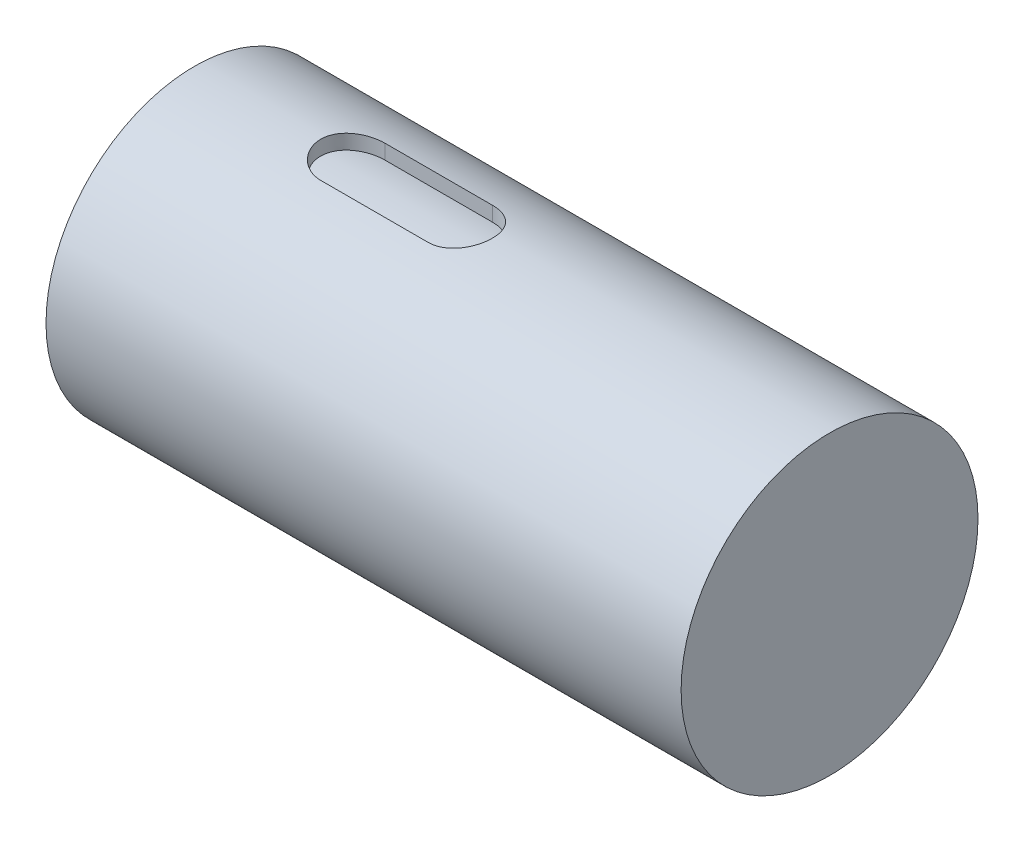
ISO-10303-21;
HEADER;
FILE_DESCRIPTION(('STEP AP214'),'2;1');
FILE_NAME('part.step','',(''),(''),'','','');
FILE_SCHEMA(('AUTOMOTIVE_DESIGN { 1 0 10303 214 1 1 1 1 }'));
ENDSEC;
DATA;
#1=APPLICATION_CONTEXT('core data for automotive mechanical design processes');
#2=APPLICATION_PROTOCOL_DEFINITION('international standard','automotive_design',2000,#1);
#3=PRODUCT_CONTEXT('',#1,'mechanical');
#4=PRODUCT('Part','Part','',(#3));
#5=PRODUCT_RELATED_PRODUCT_CATEGORY('part','',(#4));
#6=PRODUCT_DEFINITION_FORMATION('','',#4);
#7=PRODUCT_DEFINITION_CONTEXT('part definition',#1,'design');
#8=PRODUCT_DEFINITION('design','',#6,#7);
#9=PRODUCT_DEFINITION_SHAPE('','',#8);
#10=(LENGTH_UNIT() NAMED_UNIT(*) SI_UNIT(.MILLI.,.METRE.));
#11=(NAMED_UNIT(*) PLANE_ANGLE_UNIT() SI_UNIT($,.RADIAN.));
#12=(NAMED_UNIT(*) SI_UNIT($,.STERADIAN.) SOLID_ANGLE_UNIT());
#13=UNCERTAINTY_MEASURE_WITH_UNIT(LENGTH_MEASURE(1.E-05),#10,'distance_accuracy_value','');
#14=(GEOMETRIC_REPRESENTATION_CONTEXT(3) GLOBAL_UNCERTAINTY_ASSIGNED_CONTEXT((#13)) GLOBAL_UNIT_ASSIGNED_CONTEXT((#10,
#11,#12)) REPRESENTATION_CONTEXT('',''));
#15=CARTESIAN_POINT('',(0.,0.,0.));
#16=DIRECTION('',(0.,0.,1.));
#17=DIRECTION('',(1.,0.,0.));
#18=AXIS2_PLACEMENT_3D('',#15,#16,#17);
#19=CARTESIAN_POINT('',(130.,0.,0.));
#20=DIRECTION('',(-1.,0.,0.));
#21=DIRECTION('',(0.,0.,1.));
#22=AXIS2_PLACEMENT_3D('',#19,#20,#21);
#23=CYLINDRICAL_SURFACE('',#22,60.7681555195422);
#24=CARTESIAN_POINT('',(-130.,0.,0.));
#25=DIRECTION('',(1.,0.,0.));
#26=DIRECTION('',(0.,0.,-1.));
#27=AXIS2_PLACEMENT_3D('',#24,#25,#26);
#28=CIRCLE('',#27,60.7681555195422);
#29=CARTESIAN_POINT('',(-130.,0.,-60.7681555195422));
#30=VERTEX_POINT('',#29);
#31=EDGE_CURVE('E43',#30,#30,#28,.T.);
#32=ORIENTED_EDGE('',*,*,#31,.T.);
#33=EDGE_LOOP('',(#32));
#34=FACE_BOUND('',#33,.T.);
#35=CARTESIAN_POINT('',(130.,0.,0.));
#36=DIRECTION('',(1.,0.,0.));
#37=DIRECTION('',(0.,0.,-1.));
#38=AXIS2_PLACEMENT_3D('',#35,#36,#37);
#39=CIRCLE('',#38,60.7681555195422);
#40=CARTESIAN_POINT('',(130.,0.,-60.7681555195422));
#41=VERTEX_POINT('',#40);
#42=EDGE_CURVE('E11',#41,#41,#39,.T.);
#43=ORIENTED_EDGE('',*,*,#42,.F.);
#44=EDGE_LOOP('',(#43));
#45=FACE_BOUND('',#44,.T.);
#46=CARTESIAN_POINT('',(-21.2222588630616,59.3243820454148,13.1676277353563));
#47=CARTESIAN_POINT('',(-19.4771199425059,59.3243820454149,13.1676277353563));
#48=CARTESIAN_POINT('',(-17.7651329020504,59.4038251078294,12.8222554680992));
#49=CARTESIAN_POINT('',(-14.579008870894,59.6740771859081,11.4990949531283));
#50=CARTESIAN_POINT('',(-13.1218030710229,59.8629237453531,10.521387908889));
#51=CARTESIAN_POINT('',(-10.7008309812277,60.2382992785804,8.10040387236693));
#52=CARTESIAN_POINT('',(-9.72051803548849,60.4256326993225,6.63587755443867));
#53=CARTESIAN_POINT('',(-8.40491062108355,60.6897970090929,3.46994193410022));
#54=CARTESIAN_POINT('',(-8.05607540678742,60.7678425641329,1.73394894995495));
#55=CARTESIAN_POINT('',(-8.05391588354741,60.7683105031119,-0.850470309829686));
#56=CARTESIAN_POINT('',(-8.13979435694679,60.7495361151024,-1.72582243719729));
#57=CARTESIAN_POINT('',(-8.47640094026999,60.6779379579956,-3.41649622427681));
#58=CARTESIAN_POINT('',(-8.7255211642282,60.6254551424538,-4.23854423690565));
#59=CARTESIAN_POINT('',(-9.71761279524744,60.426148300215,-6.63465897919074));
#60=CARTESIAN_POINT('',(-10.6849146735676,60.2408574139847,-8.08329328862965));
#61=CARTESIAN_POINT('',(-12.5177108135997,59.9565443083504,-9.91788644958037));
#62=CARTESIAN_POINT('',(-13.1793786647249,59.8629409592454,-10.460976865175));
#63=CARTESIAN_POINT('',(-14.6022496471712,59.6884268549925,-11.4147026610442));
#64=CARTESIAN_POINT('',(-15.3728746710388,59.6067951069766,-11.8284609029469));
#65=CARTESIAN_POINT('',(-17.7580783672696,59.4043141639832,-12.819958034078));
#66=CARTESIAN_POINT('',(-19.47710014302,59.3243820454148,-13.1676277353563));
#67=CARTESIAN_POINT('',(-21.2222588630616,59.3243820454148,-13.1676277353563));
#68=B_SPLINE_CURVE_WITH_KNOTS('',3,(#46,#47,#48,#49,#50,#51,#52,#53,#54,#55,#56,#57,#58,#59,#60,
#61,#62,#63,#64,#65,#66,#67),.UNSPECIFIED.,.F.,.F.,(4,2,2,2,2,2,2,2,2,2,4),(0.,0.125,0.25,0.375,
0.5,0.5625,0.625,0.75,0.8125,0.875,1.),.UNSPECIFIED.);
#69=CARTESIAN_POINT('',(-21.2222588630616,59.3243820454148,13.1676277353563));
#70=VERTEX_POINT('',#69);
#71=CARTESIAN_POINT('',(-21.2222588630616,59.3243820454148,-13.1676277353563));
#72=VERTEX_POINT('',#71);
#73=EDGE_CURVE('E143',#70,#72,#68,.T.);
#74=ORIENTED_EDGE('',*,*,#73,.F.);
#75=DIRECTION('',(-1.,0.,0.));
#76=VECTOR('',#75,1.);
#77=CARTESIAN_POINT('',(130.,59.3243820454148,13.1676277353563));
#78=LINE('',#77,#76);
#79=CARTESIAN_POINT('',(-65.1284046774016,59.3243820454148,13.1676277353563));
#80=VERTEX_POINT('',#79);
#81=EDGE_CURVE('E155',#70,#80,#78,.T.);
#82=ORIENTED_EDGE('',*,*,#81,.T.);
#83=CARTESIAN_POINT('',(-65.1284046774016,59.3243820454148,-13.1676277353563));
#84=CARTESIAN_POINT('',(-66.8735435979573,59.3243820454148,-13.1676277353563));
#85=CARTESIAN_POINT('',(-68.5855306384128,59.4038251078294,-12.8222554680992));
#86=CARTESIAN_POINT('',(-71.7716546695692,59.6740771859081,-11.4990949531283));
#87=CARTESIAN_POINT('',(-73.2288604694403,59.8629237453531,-10.521387908889));
#88=CARTESIAN_POINT('',(-75.6498325592355,60.2382992785803,-8.10040387236693));
#89=CARTESIAN_POINT('',(-76.6301455049747,60.4256326993225,-6.63587755443867));
#90=CARTESIAN_POINT('',(-77.9457529193797,60.6897970090929,-3.46994193410022));
#91=CARTESIAN_POINT('',(-78.2945881336758,60.7678425641329,-1.73394894995495));
#92=CARTESIAN_POINT('',(-78.2967476569158,60.7683105031119,0.850470309829684));
#93=CARTESIAN_POINT('',(-78.2108691835164,60.7495361151024,1.72582243719729));
#94=CARTESIAN_POINT('',(-77.8742626001932,60.6779379579956,3.41649622427681));
#95=CARTESIAN_POINT('',(-77.625142376235,60.6254551424538,4.23854423690565));
#96=CARTESIAN_POINT('',(-76.6330507452158,60.426148300215,6.63465897919074));
#97=CARTESIAN_POINT('',(-75.6657488668956,60.2408574139847,8.08329328862966));
#98=CARTESIAN_POINT('',(-73.8329527268635,59.9565443083504,9.91788644958037));
#99=CARTESIAN_POINT('',(-73.1712848757383,59.8629409592454,10.460976865175));
#100=CARTESIAN_POINT('',(-71.748413893292,59.6884268549925,11.4147026610442));
#101=CARTESIAN_POINT('',(-70.9777888694244,59.6067951069766,11.8284609029469));
#102=CARTESIAN_POINT('',(-68.5925851731937,59.4043141639832,12.819958034078));
#103=CARTESIAN_POINT('',(-66.8735633974432,59.3243820454148,13.1676277353563));
#104=CARTESIAN_POINT('',(-65.1284046774016,59.3243820454148,13.1676277353563));
#105=B_SPLINE_CURVE_WITH_KNOTS('',3,(#83,#84,#85,#86,#87,#88,#89,#90,#91,#92,#93,#94,#95,#96,
#97,#98,#99,#100,#101,#102,#103,#104),.UNSPECIFIED.,.F.,.F.,(4,2,2,2,2,2,2,2,2,2,4),(0.,0.125,
0.250000000000001,0.375000000000001,0.500000000000001,0.562500000000001,0.625000000000002,
0.750000000000001,0.812500000000001,0.875000000000001,1.),.UNSPECIFIED.);
#106=CARTESIAN_POINT('',(-65.1284046774016,59.3243820454148,-13.1676277353563));
#107=VERTEX_POINT('',#106);
#108=EDGE_CURVE('E60',#107,#80,#105,.T.);
#109=ORIENTED_EDGE('',*,*,#108,.F.);
#110=DIRECTION('',(-1.,0.,0.));
#111=VECTOR('',#110,1.);
#112=CARTESIAN_POINT('',(130.,59.3243820454148,-13.1676277353563));
#113=LINE('',#112,#111);
#114=EDGE_CURVE('E99',#72,#107,#113,.T.);
#115=ORIENTED_EDGE('',*,*,#114,.F.);
#116=EDGE_LOOP('',(#74,#82,#109,#115));
#117=FACE_BOUND('',#116,.T.);
#118=ADVANCED_FACE('F33',(#34,#45,#117),#23,.T.);
#119=CARTESIAN_POINT('',(130.,0.,0.));
#120=DIRECTION('',(1.,0.,0.));
#121=DIRECTION('',(0.,0.,-1.));
#122=AXIS2_PLACEMENT_3D('',#119,#120,#121);
#123=PLANE('',#122);
#124=ORIENTED_EDGE('',*,*,#42,.T.);
#125=EDGE_LOOP('',(#124));
#126=FACE_BOUND('',#125,.T.);
#127=ADVANCED_FACE('F130',(#126),#123,.T.);
#128=CARTESIAN_POINT('',(-130.,0.,0.));
#129=DIRECTION('',(1.,0.,0.));
#130=DIRECTION('',(0.,0.,-1.));
#131=AXIS2_PLACEMENT_3D('',#128,#129,#130);
#132=PLANE('',#131);
#133=ORIENTED_EDGE('',*,*,#31,.F.);
#134=EDGE_LOOP('',(#133));
#135=FACE_BOUND('',#134,.T.);
#136=ADVANCED_FACE('F125',(#135),#132,.F.);
#137=CARTESIAN_POINT('',(130.,-6.,0.));
#138=DIRECTION('',(-1.,0.,0.));
#139=DIRECTION('',(0.,0.,1.));
#140=AXIS2_PLACEMENT_3D('',#137,#138,#139);
#141=CYLINDRICAL_SURFACE('',#140,60.7681555195422);
#142=DIRECTION('',(-1.,0.,0.));
#143=VECTOR('',#142,1.);
#144=CARTESIAN_POINT('',(130.,53.3243820454148,13.1676277353563));
#145=LINE('',#144,#143);
#146=CARTESIAN_POINT('',(-21.2222588630616,53.3243820454148,13.1676277353563));
#147=VERTEX_POINT('',#146);
#148=CARTESIAN_POINT('',(-65.1284046774016,53.3243820454149,13.1676277353563));
#149=VERTEX_POINT('',#148);
#150=EDGE_CURVE('E168',#147,#149,#145,.T.);
#151=ORIENTED_EDGE('',*,*,#150,.F.);
#152=CARTESIAN_POINT('',(-21.2222588630616,53.3243820454149,-13.1676277353563));
#153=CARTESIAN_POINT('',(-19.47710014302,53.3243820454149,-13.1676277353563));
#154=CARTESIAN_POINT('',(-17.7580783672696,53.4043141639832,-12.819958034078));
#155=CARTESIAN_POINT('',(-15.3728746710388,53.6067951069766,-11.8284609029469));
#156=CARTESIAN_POINT('',(-14.6022496471712,53.6884268549925,-11.4147026610442));
#157=CARTESIAN_POINT('',(-13.1793786647249,53.8629409592455,-10.460976865175));
#158=CARTESIAN_POINT('',(-12.5177108135997,53.9565443083504,-9.91788644958037));
#159=CARTESIAN_POINT('',(-10.6849146735676,54.2408574139847,-8.08329328862965));
#160=CARTESIAN_POINT('',(-9.71761279524744,54.426148300215,-6.63465897919074));
#161=CARTESIAN_POINT('',(-8.7255211642282,54.6254551424538,-4.23854423690565));
#162=CARTESIAN_POINT('',(-8.47640094026999,54.6779379579957,-3.41649622427681));
#163=CARTESIAN_POINT('',(-8.13979435694679,54.7495361151025,-1.72582243719729));
#164=CARTESIAN_POINT('',(-8.05391588354741,54.7683105031119,-0.850470309829686));
#165=CARTESIAN_POINT('',(-8.05607540678742,54.7678425641329,1.73394894995495));
#166=CARTESIAN_POINT('',(-8.40491062108355,54.689797009093,3.46994193410022));
#167=CARTESIAN_POINT('',(-9.72051803548849,54.4256326993225,6.63587755443867));
#168=CARTESIAN_POINT('',(-10.7008309812277,54.2382992785804,8.10040387236693));
#169=CARTESIAN_POINT('',(-13.1218030710229,53.8629237453531,10.521387908889));
#170=CARTESIAN_POINT('',(-14.579008870894,53.6740771859082,11.4990949531283));
#171=CARTESIAN_POINT('',(-17.7651329020504,53.4038251078294,12.8222554680992));
#172=CARTESIAN_POINT('',(-19.4771199425059,53.3243820454149,13.1676277353563));
#173=CARTESIAN_POINT('',(-21.2222588630616,53.3243820454149,13.1676277353563));
#174=B_SPLINE_CURVE_WITH_KNOTS('',3,(#152,#153,#154,#155,#156,#157,#158,#159,#160,#161,#162,
#163,#164,#165,#166,#167,#168,#169,#170,#171,#172,#173),.UNSPECIFIED.,.F.,.F.,(4,2,2,2,2,2,2,2,
2,2,4),(0.,0.125,0.1875,0.25,0.375,0.4375,0.5,0.625,0.75,0.875,1.),.UNSPECIFIED.);
#175=CARTESIAN_POINT('',(-21.2222588630616,53.3243820454148,-13.1676277353563));
#176=VERTEX_POINT('',#175);
#177=EDGE_CURVE('E78',#147,#176,#174,.F.);
#178=ORIENTED_EDGE('',*,*,#177,.T.);
#179=DIRECTION('',(-1.,0.,0.));
#180=VECTOR('',#179,1.);
#181=CARTESIAN_POINT('',(130.,53.3243820454148,-13.1676277353563));
#182=LINE('',#181,#180);
#183=CARTESIAN_POINT('',(-65.1284046774016,53.3243820454149,-13.1676277353563));
#184=VERTEX_POINT('',#183);
#185=EDGE_CURVE('E84',#176,#184,#182,.T.);
#186=ORIENTED_EDGE('',*,*,#185,.T.);
#187=CARTESIAN_POINT('',(-65.1284046774016,53.3243820454149,13.1676277353563));
#188=CARTESIAN_POINT('',(-66.8735633974432,53.3243820454149,13.1676277353563));
#189=CARTESIAN_POINT('',(-68.5925851731937,53.4043141639832,12.819958034078));
#190=CARTESIAN_POINT('',(-70.9777888694244,53.6067951069766,11.8284609029469));
#191=CARTESIAN_POINT('',(-71.748413893292,53.6884268549925,11.4147026610442));
#192=CARTESIAN_POINT('',(-73.1712848757383,53.8629409592455,10.460976865175));
#193=CARTESIAN_POINT('',(-73.8329527268635,53.9565443083504,9.91788644958037));
#194=CARTESIAN_POINT('',(-75.6657488668956,54.2408574139847,8.08329328862966));
#195=CARTESIAN_POINT('',(-76.6330507452158,54.426148300215,6.63465897919074));
#196=CARTESIAN_POINT('',(-77.625142376235,54.6254551424538,4.23854423690565));
#197=CARTESIAN_POINT('',(-77.8742626001932,54.6779379579957,3.41649622427681));
#198=CARTESIAN_POINT('',(-78.2108691835164,54.7495361151025,1.72582243719729));
#199=CARTESIAN_POINT('',(-78.2967476569158,54.7683105031119,0.850470309829684));
#200=CARTESIAN_POINT('',(-78.2945881336758,54.7678425641329,-1.73394894995495));
#201=CARTESIAN_POINT('',(-77.9457529193797,54.689797009093,-3.46994193410022));
#202=CARTESIAN_POINT('',(-76.6301455049747,54.4256326993225,-6.63587755443867));
#203=CARTESIAN_POINT('',(-75.6498325592355,54.2382992785804,-8.10040387236693));
#204=CARTESIAN_POINT('',(-73.2288604694403,53.8629237453531,-10.521387908889));
#205=CARTESIAN_POINT('',(-71.7716546695692,53.6740771859082,-11.4990949531283));
#206=CARTESIAN_POINT('',(-68.5855306384128,53.4038251078295,-12.8222554680992));
#207=CARTESIAN_POINT('',(-66.8735435979573,53.3243820454149,-13.1676277353563));
#208=CARTESIAN_POINT('',(-65.1284046774016,53.3243820454149,-13.1676277353563));
#209=B_SPLINE_CURVE_WITH_KNOTS('',3,(#187,#188,#189,#190,#191,#192,#193,#194,#195,#196,#197,
#198,#199,#200,#201,#202,#203,#204,#205,#206,#207,#208),.UNSPECIFIED.,.F.,.F.,(4,2,2,2,2,2,2,2,
2,2,4),(0.,0.124999999999999,0.187499999999999,0.249999999999999,0.374999999999998,
0.437499999999999,0.499999999999999,0.624999999999999,0.749999999999999,0.875,1.),.UNSPECIFIED.);
#210=EDGE_CURVE('E87',#184,#149,#209,.F.);
#211=ORIENTED_EDGE('',*,*,#210,.T.);
#212=EDGE_LOOP('',(#151,#178,#186,#211));
#213=FACE_BOUND('',#212,.T.);
#214=ADVANCED_FACE('F101',(#213),#141,.T.);
#215=CARTESIAN_POINT('',(130.,59.3243820454148,13.1676277353563));
#216=DIRECTION('',(0.,0.,1.));
#217=DIRECTION('',(1.,0.,0.));
#218=AXIS2_PLACEMENT_3D('',#215,#216,#217);
#219=PLANE('',#218);
#220=ORIENTED_EDGE('',*,*,#150,.T.);
#221=DIRECTION('',(0.,-1.,0.));
#222=VECTOR('',#221,1.);
#223=CARTESIAN_POINT('',(-65.1284046774016,59.3243820454148,13.1676277353563));
#224=LINE('',#223,#222);
#225=EDGE_CURVE('E91',#80,#149,#224,.T.);
#226=ORIENTED_EDGE('',*,*,#225,.F.);
#227=ORIENTED_EDGE('',*,*,#81,.F.);
#228=DIRECTION('',(0.,-1.,0.));
#229=VECTOR('',#228,1.);
#230=CARTESIAN_POINT('',(-21.2222588630616,59.3243820454148,13.1676277353563));
#231=LINE('',#230,#229);
#232=EDGE_CURVE('E174',#70,#147,#231,.T.);
#233=ORIENTED_EDGE('',*,*,#232,.T.);
#234=EDGE_LOOP('',(#220,#226,#227,#233));
#235=FACE_BOUND('',#234,.T.);
#236=ADVANCED_FACE('F124',(#235),#219,.F.);
#237=CARTESIAN_POINT('',(-21.2222588630616,59.3243820454148,13.1676277353563));
#238=CARTESIAN_POINT('',(-19.4771199425059,59.3243820454149,13.1676277353563));
#239=CARTESIAN_POINT('',(-17.7651329020504,59.4038251078294,12.8222554680992));
#240=CARTESIAN_POINT('',(-14.579008870894,59.6740771859081,11.4990949531283));
#241=CARTESIAN_POINT('',(-13.1218030710229,59.8629237453531,10.521387908889));
#242=CARTESIAN_POINT('',(-10.7008309812277,60.2382992785804,8.10040387236693));
#243=CARTESIAN_POINT('',(-9.72051803548849,60.4256326993225,6.63587755443867));
#244=CARTESIAN_POINT('',(-8.40491062108355,60.6897970090929,3.46994193410022));
#245=CARTESIAN_POINT('',(-8.05607540678742,60.7678425641329,1.73394894995495));
#246=CARTESIAN_POINT('',(-8.05391588354741,60.7683105031119,-0.850470309829686));
#247=CARTESIAN_POINT('',(-8.13979435694679,60.7495361151024,-1.72582243719729));
#248=CARTESIAN_POINT('',(-8.47640094026999,60.6779379579956,-3.41649622427681));
#249=CARTESIAN_POINT('',(-8.7255211642282,60.6254551424538,-4.23854423690565));
#250=CARTESIAN_POINT('',(-9.71761279524744,60.426148300215,-6.63465897919074));
#251=CARTESIAN_POINT('',(-10.6849146735676,60.2408574139847,-8.08329328862965));
#252=CARTESIAN_POINT('',(-12.5177108135997,59.9565443083504,-9.91788644958037));
#253=CARTESIAN_POINT('',(-13.1793786647249,59.8629409592454,-10.460976865175));
#254=CARTESIAN_POINT('',(-14.6022496471712,59.6884268549925,-11.4147026610442));
#255=CARTESIAN_POINT('',(-15.3728746710388,59.6067951069766,-11.8284609029469));
#256=CARTESIAN_POINT('',(-17.7580783672696,59.4043141639832,-12.819958034078));
#257=CARTESIAN_POINT('',(-19.47710014302,59.3243820454148,-13.1676277353563));
#258=CARTESIAN_POINT('',(-21.2222588630616,59.3243820454148,-13.1676277353563));
#259=B_SPLINE_CURVE_WITH_KNOTS('',3,(#237,#238,#239,#240,#241,#242,#243,#244,#245,#246,#247,
#248,#249,#250,#251,#252,#253,#254,#255,#256,#257,#258),.UNSPECIFIED.,.F.,.F.,(4,2,2,2,2,2,2,2,
2,2,4),(0.,0.125,0.25,0.375,0.5,0.5625,0.625,0.75,0.8125,0.875,1.),.UNSPECIFIED.);
#260=DIRECTION('',(0.,-1.,0.));
#261=VECTOR('',#260,1.);
#262=SURFACE_OF_LINEAR_EXTRUSION('',#259,#261);
#263=ORIENTED_EDGE('',*,*,#177,.F.);
#264=ORIENTED_EDGE('',*,*,#232,.F.);
#265=ORIENTED_EDGE('',*,*,#73,.T.);
#266=DIRECTION('',(0.,-1.,0.));
#267=VECTOR('',#266,1.);
#268=CARTESIAN_POINT('',(-21.2222588630616,59.3243820454148,-13.1676277353563));
#269=LINE('',#268,#267);
#270=EDGE_CURVE('E51',#72,#176,#269,.T.);
#271=ORIENTED_EDGE('',*,*,#270,.T.);
#272=EDGE_LOOP('',(#263,#264,#265,#271));
#273=FACE_BOUND('',#272,.T.);
#274=ADVANCED_FACE('F126',(#273),#262,.T.);
#275=CARTESIAN_POINT('',(130.,59.3243820454148,-13.1676277353563));
#276=DIRECTION('',(0.,0.,1.));
#277=DIRECTION('',(1.,0.,0.));
#278=AXIS2_PLACEMENT_3D('',#275,#276,#277);
#279=PLANE('',#278);
#280=ORIENTED_EDGE('',*,*,#185,.F.);
#281=ORIENTED_EDGE('',*,*,#270,.F.);
#282=ORIENTED_EDGE('',*,*,#114,.T.);
#283=DIRECTION('',(0.,-1.,0.));
#284=VECTOR('',#283,1.);
#285=CARTESIAN_POINT('',(-65.1284046774016,59.3243820454148,-13.1676277353563));
#286=LINE('',#285,#284);
#287=EDGE_CURVE('E90',#107,#184,#286,.T.);
#288=ORIENTED_EDGE('',*,*,#287,.T.);
#289=EDGE_LOOP('',(#280,#281,#282,#288));
#290=FACE_BOUND('',#289,.T.);
#291=ADVANCED_FACE('F97',(#290),#279,.T.);
#292=CARTESIAN_POINT('',(-65.1284046774016,59.3243820454148,-13.1676277353563));
#293=CARTESIAN_POINT('',(-66.8735435979573,59.3243820454148,-13.1676277353563));
#294=CARTESIAN_POINT('',(-68.5855306384128,59.4038251078294,-12.8222554680992));
#295=CARTESIAN_POINT('',(-71.7716546695692,59.6740771859081,-11.4990949531283));
#296=CARTESIAN_POINT('',(-73.2288604694403,59.8629237453531,-10.521387908889));
#297=CARTESIAN_POINT('',(-75.6498325592355,60.2382992785803,-8.10040387236693));
#298=CARTESIAN_POINT('',(-76.6301455049747,60.4256326993225,-6.63587755443867));
#299=CARTESIAN_POINT('',(-77.9457529193797,60.6897970090929,-3.46994193410022));
#300=CARTESIAN_POINT('',(-78.2945881336758,60.7678425641329,-1.73394894995495));
#301=CARTESIAN_POINT('',(-78.2967476569158,60.7683105031119,0.850470309829684));
#302=CARTESIAN_POINT('',(-78.2108691835164,60.7495361151024,1.72582243719729));
#303=CARTESIAN_POINT('',(-77.8742626001932,60.6779379579956,3.41649622427681));
#304=CARTESIAN_POINT('',(-77.625142376235,60.6254551424538,4.23854423690565));
#305=CARTESIAN_POINT('',(-76.6330507452158,60.426148300215,6.63465897919074));
#306=CARTESIAN_POINT('',(-75.6657488668956,60.2408574139847,8.08329328862966));
#307=CARTESIAN_POINT('',(-73.8329527268635,59.9565443083504,9.91788644958037));
#308=CARTESIAN_POINT('',(-73.1712848757383,59.8629409592454,10.460976865175));
#309=CARTESIAN_POINT('',(-71.748413893292,59.6884268549925,11.4147026610442));
#310=CARTESIAN_POINT('',(-70.9777888694244,59.6067951069766,11.8284609029469));
#311=CARTESIAN_POINT('',(-68.5925851731937,59.4043141639832,12.819958034078));
#312=CARTESIAN_POINT('',(-66.8735633974432,59.3243820454148,13.1676277353563));
#313=CARTESIAN_POINT('',(-65.1284046774016,59.3243820454148,13.1676277353563));
#314=B_SPLINE_CURVE_WITH_KNOTS('',3,(#292,#293,#294,#295,#296,#297,#298,#299,#300,#301,#302,
#303,#304,#305,#306,#307,#308,#309,#310,#311,#312,#313),.UNSPECIFIED.,.F.,.F.,(4,2,2,2,2,2,2,2,
2,2,4),(0.,0.125,0.250000000000001,0.375000000000001,0.500000000000001,0.562500000000001,
0.625000000000002,0.750000000000001,0.812500000000001,0.875000000000001,1.),.UNSPECIFIED.);
#315=DIRECTION('',(0.,-1.,0.));
#316=VECTOR('',#315,1.);
#317=SURFACE_OF_LINEAR_EXTRUSION('',#314,#316);
#318=ORIENTED_EDGE('',*,*,#210,.F.);
#319=ORIENTED_EDGE('',*,*,#287,.F.);
#320=ORIENTED_EDGE('',*,*,#108,.T.);
#321=ORIENTED_EDGE('',*,*,#225,.T.);
#322=EDGE_LOOP('',(#318,#319,#320,#321));
#323=FACE_BOUND('',#322,.T.);
#324=ADVANCED_FACE('F89',(#323),#317,.T.);
#325=CLOSED_SHELL('',(#118,#127,#136,#214,#236,#274,#291,#324));
#326=MANIFOLD_SOLID_BREP('B2',#325);
#327=ADVANCED_BREP_SHAPE_REPRESENTATION('',(#18,#326),#14);
#328=SHAPE_DEFINITION_REPRESENTATION(#9,#327);
ENDSEC;
END-ISO-10303-21;
